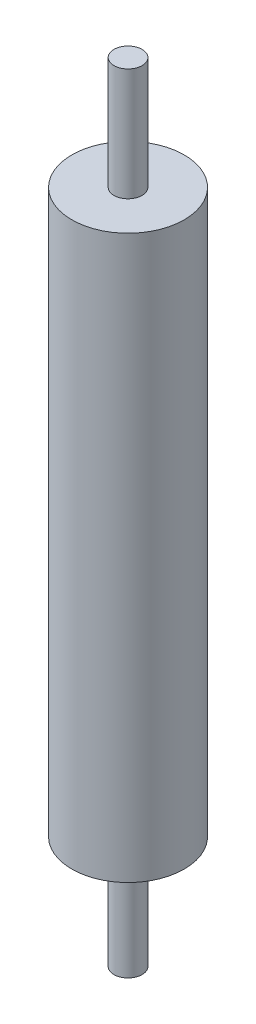
ISO-10303-21;
HEADER;
FILE_DESCRIPTION(('STEP AP214'),'2;1');
FILE_NAME('part.step','',(''),(''),'','','');
FILE_SCHEMA(('AUTOMOTIVE_DESIGN { 1 0 10303 214 1 1 1 1 }'));
ENDSEC;
DATA;
#1=APPLICATION_CONTEXT('core data for automotive mechanical design processes');
#2=APPLICATION_PROTOCOL_DEFINITION('international standard','automotive_design',2000,#1);
#3=PRODUCT_CONTEXT('',#1,'mechanical');
#4=PRODUCT('Part','Part','',(#3));
#5=PRODUCT_RELATED_PRODUCT_CATEGORY('part','',(#4));
#6=PRODUCT_DEFINITION_FORMATION('','',#4);
#7=PRODUCT_DEFINITION_CONTEXT('part definition',#1,'design');
#8=PRODUCT_DEFINITION('design','',#6,#7);
#9=PRODUCT_DEFINITION_SHAPE('','',#8);
#10=(LENGTH_UNIT() NAMED_UNIT(*) SI_UNIT(.MILLI.,.METRE.));
#11=(NAMED_UNIT(*) PLANE_ANGLE_UNIT() SI_UNIT($,.RADIAN.));
#12=(NAMED_UNIT(*) SI_UNIT($,.STERADIAN.) SOLID_ANGLE_UNIT());
#13=UNCERTAINTY_MEASURE_WITH_UNIT(LENGTH_MEASURE(1.E-05),#10,'distance_accuracy_value','');
#14=(GEOMETRIC_REPRESENTATION_CONTEXT(3) GLOBAL_UNCERTAINTY_ASSIGNED_CONTEXT((#13)) GLOBAL_UNIT_ASSIGNED_CONTEXT((#10,
#11,#12)) REPRESENTATION_CONTEXT('',''));
#15=CARTESIAN_POINT('',(0.,0.,0.));
#16=DIRECTION('',(0.,0.,1.));
#17=DIRECTION('',(1.,0.,0.));
#18=AXIS2_PLACEMENT_3D('',#15,#16,#17);
#19=CARTESIAN_POINT('',(-10.,50.,0.));
#20=DIRECTION('',(0.,-1.,0.));
#21=DIRECTION('',(1.,0.,0.));
#22=AXIS2_PLACEMENT_3D('',#19,#20,#21);
#23=PLANE('',#22);
#24=CARTESIAN_POINT('',(0.,50.,0.));
#25=DIRECTION('',(0.,-1.,0.));
#26=DIRECTION('',(1.,0.,0.));
#27=AXIS2_PLACEMENT_3D('',#24,#25,#26);
#28=CIRCLE('',#27,10.);
#29=CARTESIAN_POINT('',(10.,50.,0.));
#30=VERTEX_POINT('',#29);
#31=EDGE_CURVE('E10',#30,#30,#28,.T.);
#32=ORIENTED_EDGE('',*,*,#31,.F.);
#33=EDGE_LOOP('',(#32));
#34=FACE_BOUND('',#33,.T.);
#35=CARTESIAN_POINT('',(0.,50.,0.));
#36=DIRECTION('',(0.,-1.,0.));
#37=DIRECTION('',(1.,0.,0.));
#38=AXIS2_PLACEMENT_3D('',#35,#36,#37);
#39=CIRCLE('',#38,2.5);
#40=CARTESIAN_POINT('',(2.50000000000001,50.,0.));
#41=VERTEX_POINT('',#40);
#42=EDGE_CURVE('E57',#41,#41,#39,.T.);
#43=ORIENTED_EDGE('',*,*,#42,.T.);
#44=EDGE_LOOP('',(#43));
#45=FACE_BOUND('',#44,.T.);
#46=ADVANCED_FACE('F35',(#34,#45),#23,.F.);
#47=CARTESIAN_POINT('',(0.,-70.,0.));
#48=DIRECTION('',(0.,-1.,0.));
#49=DIRECTION('',(1.,0.,0.));
#50=AXIS2_PLACEMENT_3D('',#47,#48,#49);
#51=CYLINDRICAL_SURFACE('',#50,10.);
#52=CARTESIAN_POINT('',(0.,-50.,0.));
#53=DIRECTION('',(0.,-1.,0.));
#54=DIRECTION('',(1.,0.,0.));
#55=AXIS2_PLACEMENT_3D('',#52,#53,#54);
#56=CIRCLE('',#55,10.);
#57=CARTESIAN_POINT('',(10.,-50.,0.));
#58=VERTEX_POINT('',#57);
#59=EDGE_CURVE('E41',#58,#58,#56,.T.);
#60=ORIENTED_EDGE('',*,*,#59,.F.);
#61=EDGE_LOOP('',(#60));
#62=FACE_BOUND('',#61,.T.);
#63=ORIENTED_EDGE('',*,*,#31,.T.);
#64=EDGE_LOOP('',(#63));
#65=FACE_BOUND('',#64,.T.);
#66=ADVANCED_FACE('F79',(#62,#65),#51,.T.);
#67=CARTESIAN_POINT('',(-9.99999999999997,-50.,0.));
#68=DIRECTION('',(0.,1.,0.));
#69=DIRECTION('',(-1.,0.,0.));
#70=AXIS2_PLACEMENT_3D('',#67,#68,#69);
#71=PLANE('',#70);
#72=CARTESIAN_POINT('',(0.,-50.,0.));
#73=DIRECTION('',(0.,-1.,0.));
#74=DIRECTION('',(1.,0.,0.));
#75=AXIS2_PLACEMENT_3D('',#72,#73,#74);
#76=CIRCLE('',#75,2.5);
#77=CARTESIAN_POINT('',(2.50000000000003,-50.,0.));
#78=VERTEX_POINT('',#77);
#79=EDGE_CURVE('E45',#78,#78,#76,.T.);
#80=ORIENTED_EDGE('',*,*,#79,.F.);
#81=EDGE_LOOP('',(#80));
#82=FACE_BOUND('',#81,.T.);
#83=ORIENTED_EDGE('',*,*,#59,.T.);
#84=EDGE_LOOP('',(#83));
#85=FACE_BOUND('',#84,.T.);
#86=ADVANCED_FACE('F84',(#82,#85),#71,.F.);
#87=CARTESIAN_POINT('',(0.,-70.,0.));
#88=DIRECTION('',(0.,-1.,0.));
#89=DIRECTION('',(1.,0.,0.));
#90=AXIS2_PLACEMENT_3D('',#87,#88,#89);
#91=CYLINDRICAL_SURFACE('',#90,2.5);
#92=CARTESIAN_POINT('',(0.,-70.,0.));
#93=DIRECTION('',(0.,-1.,0.));
#94=DIRECTION('',(1.,0.,0.));
#95=AXIS2_PLACEMENT_3D('',#92,#93,#94);
#96=CIRCLE('',#95,2.5);
#97=CARTESIAN_POINT('',(2.50000000000003,-70.,0.));
#98=VERTEX_POINT('',#97);
#99=EDGE_CURVE('E49',#98,#98,#96,.T.);
#100=ORIENTED_EDGE('',*,*,#99,.F.);
#101=EDGE_LOOP('',(#100));
#102=FACE_BOUND('',#101,.T.);
#103=ORIENTED_EDGE('',*,*,#79,.T.);
#104=EDGE_LOOP('',(#103));
#105=FACE_BOUND('',#104,.T.);
#106=ADVANCED_FACE('F75',(#102,#105),#91,.T.);
#107=CARTESIAN_POINT('',(-2.49999999999996,-70.,0.));
#108=DIRECTION('',(0.,1.,0.));
#109=DIRECTION('',(-1.,0.,0.));
#110=AXIS2_PLACEMENT_3D('',#107,#108,#109);
#111=PLANE('',#110);
#112=ORIENTED_EDGE('',*,*,#99,.T.);
#113=EDGE_LOOP('',(#112));
#114=FACE_BOUND('',#113,.T.);
#115=ADVANCED_FACE('F70',(#114),#111,.F.);
#116=CARTESIAN_POINT('',(-2.5,70.,0.));
#117=DIRECTION('',(0.,-1.,0.));
#118=DIRECTION('',(1.,0.,0.));
#119=AXIS2_PLACEMENT_3D('',#116,#117,#118);
#120=PLANE('',#119);
#121=CARTESIAN_POINT('',(0.,70.,0.));
#122=DIRECTION('',(0.,-1.,0.));
#123=DIRECTION('',(1.,0.,0.));
#124=AXIS2_PLACEMENT_3D('',#121,#122,#123);
#125=CIRCLE('',#124,2.5);
#126=CARTESIAN_POINT('',(2.5,70.,0.));
#127=VERTEX_POINT('',#126);
#128=EDGE_CURVE('E54',#127,#127,#125,.T.);
#129=ORIENTED_EDGE('',*,*,#128,.F.);
#130=EDGE_LOOP('',(#129));
#131=FACE_BOUND('',#130,.T.);
#132=ADVANCED_FACE('F65',(#131),#120,.F.);
#133=CARTESIAN_POINT('',(0.,-70.,0.));
#134=DIRECTION('',(0.,-1.,0.));
#135=DIRECTION('',(1.,0.,0.));
#136=AXIS2_PLACEMENT_3D('',#133,#134,#135);
#137=CYLINDRICAL_SURFACE('',#136,2.5);
#138=ORIENTED_EDGE('',*,*,#42,.F.);
#139=EDGE_LOOP('',(#138));
#140=FACE_BOUND('',#139,.T.);
#141=ORIENTED_EDGE('',*,*,#128,.T.);
#142=EDGE_LOOP('',(#141));
#143=FACE_BOUND('',#142,.T.);
#144=ADVANCED_FACE('F62',(#140,#143),#137,.T.);
#145=CLOSED_SHELL('',(#46,#66,#86,#106,#115,#132,#144));
#146=MANIFOLD_SOLID_BREP('B2',#145);
#147=ADVANCED_BREP_SHAPE_REPRESENTATION('',(#18,#146),#14);
#148=SHAPE_DEFINITION_REPRESENTATION(#9,#147);
ENDSEC;
END-ISO-10303-21;
